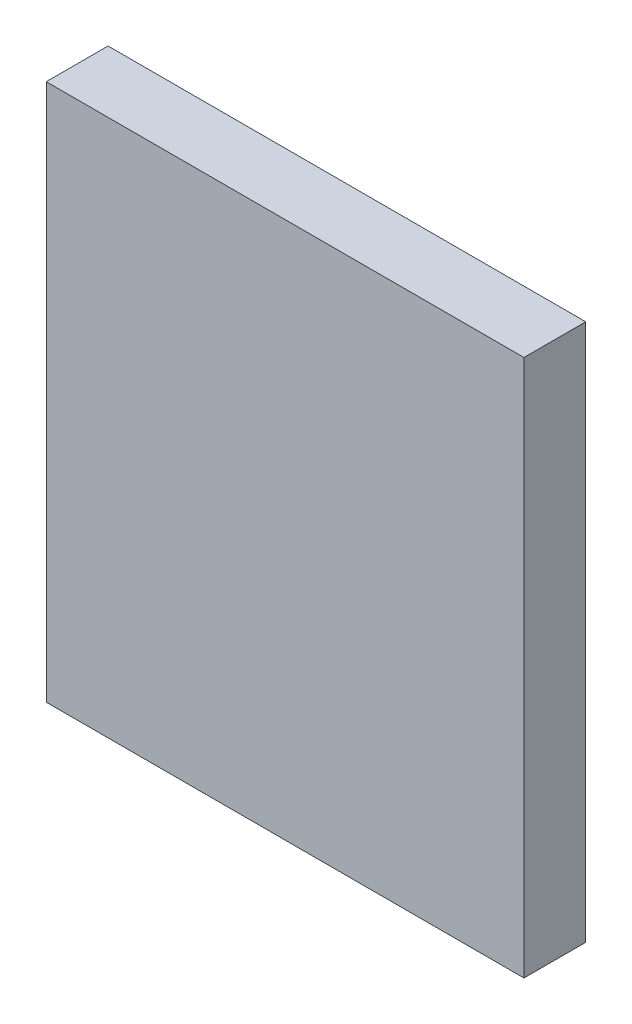
ISO-10303-21;
HEADER;
FILE_DESCRIPTION(('STEP AP214'),'2;1');
FILE_NAME('part.step','',(''),(''),'','','');
FILE_SCHEMA(('AUTOMOTIVE_DESIGN { 1 0 10303 214 1 1 1 1 }'));
ENDSEC;
DATA;
#1=APPLICATION_CONTEXT('core data for automotive mechanical design processes');
#2=APPLICATION_PROTOCOL_DEFINITION('international standard','automotive_design',2000,#1);
#3=PRODUCT_CONTEXT('',#1,'mechanical');
#4=PRODUCT('Part','Part','',(#3));
#5=PRODUCT_RELATED_PRODUCT_CATEGORY('part','',(#4));
#6=PRODUCT_DEFINITION_FORMATION('','',#4);
#7=PRODUCT_DEFINITION_CONTEXT('part definition',#1,'design');
#8=PRODUCT_DEFINITION('design','',#6,#7);
#9=PRODUCT_DEFINITION_SHAPE('','',#8);
#10=(LENGTH_UNIT() NAMED_UNIT(*) SI_UNIT(.MILLI.,.METRE.));
#11=(NAMED_UNIT(*) PLANE_ANGLE_UNIT() SI_UNIT($,.RADIAN.));
#12=(NAMED_UNIT(*) SI_UNIT($,.STERADIAN.) SOLID_ANGLE_UNIT());
#13=UNCERTAINTY_MEASURE_WITH_UNIT(LENGTH_MEASURE(1.E-05),#10,'distance_accuracy_value','');
#14=(GEOMETRIC_REPRESENTATION_CONTEXT(3) GLOBAL_UNCERTAINTY_ASSIGNED_CONTEXT((#13)) GLOBAL_UNIT_ASSIGNED_CONTEXT((#10,
#11,#12)) REPRESENTATION_CONTEXT('',''));
#15=CARTESIAN_POINT('',(0.,0.,0.));
#16=DIRECTION('',(0.,0.,1.));
#17=DIRECTION('',(1.,0.,0.));
#18=AXIS2_PLACEMENT_3D('',#15,#16,#17);
#19=CARTESIAN_POINT('',(0.,0.,17.6));
#20=DIRECTION('',(1.,0.,0.));
#21=DIRECTION('',(0.,0.,-1.));
#22=AXIS2_PLACEMENT_3D('',#19,#20,#21);
#23=PLANE('',#22);
#24=DIRECTION('',(0.,-1.,0.));
#25=VECTOR('',#24,1.);
#26=CARTESIAN_POINT('',(0.,0.,0.));
#27=LINE('',#26,#25);
#28=CARTESIAN_POINT('',(0.,153.,0.));
#29=VERTEX_POINT('',#28);
#30=CARTESIAN_POINT('',(0.,0.,0.));
#31=VERTEX_POINT('',#30);
#32=EDGE_CURVE('E113',#29,#31,#27,.T.);
#33=ORIENTED_EDGE('',*,*,#32,.T.);
#34=DIRECTION('',(0.,0.,-1.));
#35=VECTOR('',#34,1.);
#36=CARTESIAN_POINT('',(0.,0.,17.6));
#37=LINE('',#36,#35);
#38=CARTESIAN_POINT('',(0.,0.,17.6));
#39=VERTEX_POINT('',#38);
#40=EDGE_CURVE('E11',#39,#31,#37,.T.);
#41=ORIENTED_EDGE('',*,*,#40,.F.);
#42=DIRECTION('',(0.,-1.,0.));
#43=VECTOR('',#42,1.);
#44=CARTESIAN_POINT('',(0.,0.,17.6));
#45=LINE('',#44,#43);
#46=CARTESIAN_POINT('',(0.,153.,17.6));
#47=VERTEX_POINT('',#46);
#48=EDGE_CURVE('E97',#47,#39,#45,.T.);
#49=ORIENTED_EDGE('',*,*,#48,.F.);
#50=DIRECTION('',(0.,0.,-1.));
#51=VECTOR('',#50,1.);
#52=CARTESIAN_POINT('',(0.,153.,17.6));
#53=LINE('',#52,#51);
#54=EDGE_CURVE('E109',#47,#29,#53,.T.);
#55=ORIENTED_EDGE('',*,*,#54,.T.);
#56=EDGE_LOOP('',(#33,#41,#49,#55));
#57=FACE_BOUND('',#56,.T.);
#58=ADVANCED_FACE('F45',(#57),#23,.F.);
#59=CARTESIAN_POINT('',(0.,0.,17.6));
#60=DIRECTION('',(0.,1.,0.));
#61=DIRECTION('',(0.,0.,1.));
#62=AXIS2_PLACEMENT_3D('',#59,#60,#61);
#63=PLANE('',#62);
#64=DIRECTION('',(1.,0.,0.));
#65=VECTOR('',#64,1.);
#66=CARTESIAN_POINT('',(0.,0.,0.));
#67=LINE('',#66,#65);
#68=CARTESIAN_POINT('',(136.,0.,0.));
#69=VERTEX_POINT('',#68);
#70=EDGE_CURVE('E102',#31,#69,#67,.T.);
#71=ORIENTED_EDGE('',*,*,#70,.T.);
#72=DIRECTION('',(0.,0.,-1.));
#73=VECTOR('',#72,1.);
#74=CARTESIAN_POINT('',(136.,0.,17.6));
#75=LINE('',#74,#73);
#76=CARTESIAN_POINT('',(136.,0.,17.6));
#77=VERTEX_POINT('',#76);
#78=EDGE_CURVE('E54',#77,#69,#75,.T.);
#79=ORIENTED_EDGE('',*,*,#78,.F.);
#80=DIRECTION('',(1.,0.,0.));
#81=VECTOR('',#80,1.);
#82=CARTESIAN_POINT('',(0.,0.,17.6));
#83=LINE('',#82,#81);
#84=EDGE_CURVE('E92',#39,#77,#83,.T.);
#85=ORIENTED_EDGE('',*,*,#84,.F.);
#86=ORIENTED_EDGE('',*,*,#40,.T.);
#87=EDGE_LOOP('',(#71,#79,#85,#86));
#88=FACE_BOUND('',#87,.T.);
#89=ADVANCED_FACE('F101',(#88),#63,.F.);
#90=CARTESIAN_POINT('',(136.,0.,17.6));
#91=DIRECTION('',(-1.,0.,0.));
#92=DIRECTION('',(0.,0.,1.));
#93=AXIS2_PLACEMENT_3D('',#90,#91,#92);
#94=PLANE('',#93);
#95=DIRECTION('',(0.,1.,0.));
#96=VECTOR('',#95,1.);
#97=CARTESIAN_POINT('',(136.,0.,0.));
#98=LINE('',#97,#96);
#99=CARTESIAN_POINT('',(136.,153.,0.));
#100=VERTEX_POINT('',#99);
#101=EDGE_CURVE('E79',#69,#100,#98,.T.);
#102=ORIENTED_EDGE('',*,*,#101,.T.);
#103=DIRECTION('',(0.,0.,-1.));
#104=VECTOR('',#103,1.);
#105=CARTESIAN_POINT('',(136.,153.,17.6));
#106=LINE('',#105,#104);
#107=CARTESIAN_POINT('',(136.,153.,17.6));
#108=VERTEX_POINT('',#107);
#109=EDGE_CURVE('E104',#108,#100,#106,.T.);
#110=ORIENTED_EDGE('',*,*,#109,.F.);
#111=DIRECTION('',(0.,1.,0.));
#112=VECTOR('',#111,1.);
#113=CARTESIAN_POINT('',(136.,0.,17.6));
#114=LINE('',#113,#112);
#115=EDGE_CURVE('E95',#77,#108,#114,.T.);
#116=ORIENTED_EDGE('',*,*,#115,.F.);
#117=ORIENTED_EDGE('',*,*,#78,.T.);
#118=EDGE_LOOP('',(#102,#110,#116,#117));
#119=FACE_BOUND('',#118,.T.);
#120=ADVANCED_FACE('F105',(#119),#94,.F.);
#121=CARTESIAN_POINT('',(0.,153.,17.6));
#122=DIRECTION('',(0.,-1.,0.));
#123=DIRECTION('',(0.,0.,-1.));
#124=AXIS2_PLACEMENT_3D('',#121,#122,#123);
#125=PLANE('',#124);
#126=DIRECTION('',(-1.,0.,0.));
#127=VECTOR('',#126,1.);
#128=CARTESIAN_POINT('',(0.,153.,0.));
#129=LINE('',#128,#127);
#130=EDGE_CURVE('E85',#100,#29,#129,.T.);
#131=ORIENTED_EDGE('',*,*,#130,.T.);
#132=ORIENTED_EDGE('',*,*,#54,.F.);
#133=DIRECTION('',(-1.,0.,0.));
#134=VECTOR('',#133,1.);
#135=CARTESIAN_POINT('',(0.,153.,17.6));
#136=LINE('',#135,#134);
#137=EDGE_CURVE('E62',#108,#47,#136,.T.);
#138=ORIENTED_EDGE('',*,*,#137,.F.);
#139=ORIENTED_EDGE('',*,*,#109,.T.);
#140=EDGE_LOOP('',(#131,#132,#138,#139));
#141=FACE_BOUND('',#140,.T.);
#142=ADVANCED_FACE('F126',(#141),#125,.F.);
#143=CARTESIAN_POINT('',(0.,0.,17.6));
#144=DIRECTION('',(0.,0.,-1.));
#145=DIRECTION('',(-1.,0.,0.));
#146=AXIS2_PLACEMENT_3D('',#143,#144,#145);
#147=PLANE('',#146);
#148=ORIENTED_EDGE('',*,*,#48,.T.);
#149=ORIENTED_EDGE('',*,*,#84,.T.);
#150=ORIENTED_EDGE('',*,*,#115,.T.);
#151=ORIENTED_EDGE('',*,*,#137,.T.);
#152=EDGE_LOOP('',(#148,#149,#150,#151));
#153=FACE_BOUND('',#152,.T.);
#154=ADVANCED_FACE('F93',(#153),#147,.F.);
#155=CARTESIAN_POINT('',(0.,0.,0.));
#156=DIRECTION('',(0.,0.,-1.));
#157=DIRECTION('',(-1.,0.,0.));
#158=AXIS2_PLACEMENT_3D('',#155,#156,#157);
#159=PLANE('',#158);
#160=ORIENTED_EDGE('',*,*,#32,.F.);
#161=ORIENTED_EDGE('',*,*,#130,.F.);
#162=ORIENTED_EDGE('',*,*,#101,.F.);
#163=ORIENTED_EDGE('',*,*,#70,.F.);
#164=EDGE_LOOP('',(#160,#161,#162,#163));
#165=FACE_BOUND('',#164,.T.);
#166=ADVANCED_FACE('F129',(#165),#159,.T.);
#167=CLOSED_SHELL('',(#58,#89,#120,#142,#154,#166));
#168=MANIFOLD_SOLID_BREP('B2',#167);
#169=ADVANCED_BREP_SHAPE_REPRESENTATION('',(#18,#168),#14);
#170=SHAPE_DEFINITION_REPRESENTATION(#9,#169);
ENDSEC;
END-ISO-10303-21;
